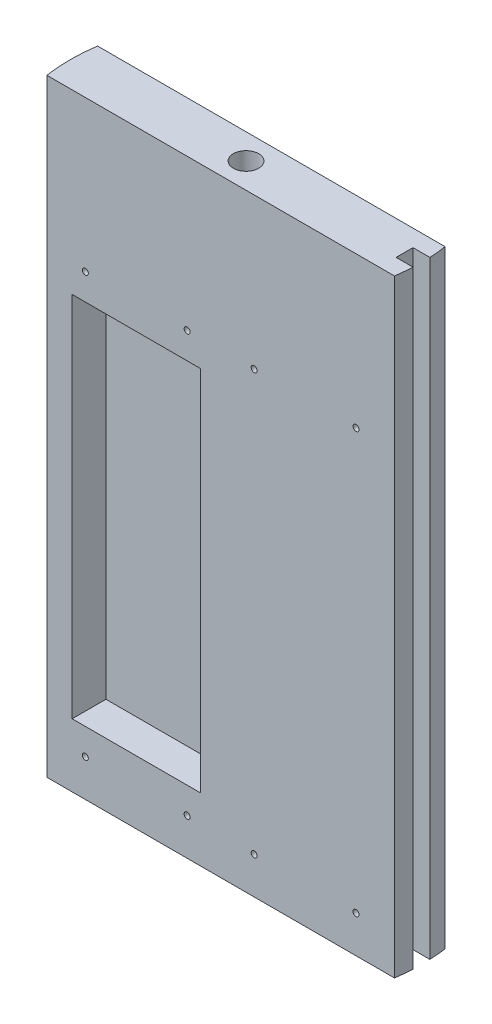
ISO-10303-21;
HEADER;
FILE_DESCRIPTION(('STEP AP214'),'2;1');
FILE_NAME('part.step','',(''),(''),'','','');
FILE_SCHEMA(('AUTOMOTIVE_DESIGN { 1 0 10303 214 1 1 1 1 }'));
ENDSEC;
DATA;
#1=APPLICATION_CONTEXT('core data for automotive mechanical design processes');
#2=APPLICATION_PROTOCOL_DEFINITION('international standard','automotive_design',2000,#1);
#3=PRODUCT_CONTEXT('',#1,'mechanical');
#4=PRODUCT('Part','Part','',(#3));
#5=PRODUCT_RELATED_PRODUCT_CATEGORY('part','',(#4));
#6=PRODUCT_DEFINITION_FORMATION('','',#4);
#7=PRODUCT_DEFINITION_CONTEXT('part definition',#1,'design');
#8=PRODUCT_DEFINITION('design','',#6,#7);
#9=PRODUCT_DEFINITION_SHAPE('','',#8);
#10=(LENGTH_UNIT() NAMED_UNIT(*) SI_UNIT(.MILLI.,.METRE.));
#11=(NAMED_UNIT(*) PLANE_ANGLE_UNIT() SI_UNIT($,.RADIAN.));
#12=(NAMED_UNIT(*) SI_UNIT($,.STERADIAN.) SOLID_ANGLE_UNIT());
#13=UNCERTAINTY_MEASURE_WITH_UNIT(LENGTH_MEASURE(1.E-05),#10,'distance_accuracy_value','');
#14=(GEOMETRIC_REPRESENTATION_CONTEXT(3) GLOBAL_UNCERTAINTY_ASSIGNED_CONTEXT((#13)) GLOBAL_UNIT_ASSIGNED_CONTEXT((#10,
#11,#12)) REPRESENTATION_CONTEXT('',''));
#15=CARTESIAN_POINT('',(0.,0.,0.));
#16=DIRECTION('',(0.,0.,1.));
#17=DIRECTION('',(1.,0.,0.));
#18=AXIS2_PLACEMENT_3D('',#15,#16,#17);
#19=CARTESIAN_POINT('',(0.,-362.046726823853,0.));
#20=DIRECTION('',(0.,1.,0.));
#21=DIRECTION('',(0.,0.,1.));
#22=AXIS2_PLACEMENT_3D('',#19,#20,#21);
#23=CYLINDRICAL_SURFACE('',#22,66.04);
#24=DIRECTION('',(0.,-1.,0.));
#25=VECTOR('',#24,1.);
#26=CARTESIAN_POINT('',(65.9636337310188,0.,3.17499999999985));
#27=LINE('',#26,#25);
#28=CARTESIAN_POINT('',(65.9636337310188,0.,3.17499999999985));
#29=VERTEX_POINT('',#28);
#30=CARTESIAN_POINT('',(65.9636337310188,-228.6,3.17499999999985));
#31=VERTEX_POINT('',#30);
#32=EDGE_CURVE('E235',#29,#31,#27,.T.);
#33=ORIENTED_EDGE('',*,*,#32,.F.);
#34=CARTESIAN_POINT('',(0.,0.,0.));
#35=DIRECTION('',(0.,1.,0.));
#36=DIRECTION('',(0.,0.,1.));
#37=AXIS2_PLACEMENT_3D('',#34,#35,#36);
#38=CIRCLE('',#37,66.04);
#39=CARTESIAN_POINT('',(65.3494910079642,0.,9.52499999999994));
#40=VERTEX_POINT('',#39);
#41=EDGE_CURVE('E309',#40,#29,#38,.T.);
#42=ORIENTED_EDGE('',*,*,#41,.F.);
#43=DIRECTION('',(0.,1.,0.));
#44=VECTOR('',#43,1.);
#45=CARTESIAN_POINT('',(65.3494910079642,-362.046726823853,9.52499999999994));
#46=LINE('',#45,#44);
#47=CARTESIAN_POINT('',(65.3494910079642,-228.6,9.52499999999994));
#48=VERTEX_POINT('',#47);
#49=EDGE_CURVE('E321',#48,#40,#46,.T.);
#50=ORIENTED_EDGE('',*,*,#49,.F.);
#51=CARTESIAN_POINT('',(0.,-228.6,0.));
#52=DIRECTION('',(0.,1.,0.));
#53=DIRECTION('',(0.,0.,1.));
#54=AXIS2_PLACEMENT_3D('',#51,#52,#53);
#55=CIRCLE('',#54,66.04);
#56=EDGE_CURVE('E300',#31,#48,#55,.F.);
#57=ORIENTED_EDGE('',*,*,#56,.F.);
#58=EDGE_LOOP('',(#33,#42,#50,#57));
#59=FACE_BOUND('',#58,.T.);
#60=ADVANCED_FACE('F35',(#59),#23,.T.);
#61=CARTESIAN_POINT('',(-65.3494910079642,-362.046726823853,-9.52499999999998));
#62=DIRECTION('',(0.,0.,-1.));
#63=DIRECTION('',(-1.,0.,0.));
#64=AXIS2_PLACEMENT_3D('',#61,#62,#63);
#65=PLANE('',#64);
#66=DIRECTION('',(0.,-1.,0.));
#67=VECTOR('',#66,1.);
#68=CARTESIAN_POINT('',(55.8375,-66.6125,-9.52499999999998));
#69=LINE('',#68,#67);
#70=CARTESIAN_POINT('',(55.8375,-66.6125,-9.52499999999998));
#71=VERTEX_POINT('',#70);
#72=CARTESIAN_POINT('',(55.8375,-204.7875,-9.52499999999998));
#73=VERTEX_POINT('',#72);
#74=EDGE_CURVE('E50',#71,#73,#69,.T.);
#75=ORIENTED_EDGE('',*,*,#74,.F.);
#76=DIRECTION('',(1.,0.,0.));
#77=VECTOR('',#76,1.);
#78=CARTESIAN_POINT('',(55.8375,-66.6125,-9.52499999999998));
#79=LINE('',#78,#77);
#80=CARTESIAN_POINT('',(7.66249999999997,-66.6125,-9.52499999999998));
#81=VERTEX_POINT('',#80);
#82=EDGE_CURVE('E167',#81,#71,#79,.T.);
#83=ORIENTED_EDGE('',*,*,#82,.F.);
#84=DIRECTION('',(0.,1.,0.));
#85=VECTOR('',#84,1.);
#86=CARTESIAN_POINT('',(7.66249999999997,-66.6125,-9.52499999999998));
#87=LINE('',#86,#85);
#88=CARTESIAN_POINT('',(7.66249999999996,-204.7875,-9.52499999999998));
#89=VERTEX_POINT('',#88);
#90=EDGE_CURVE('E170',#89,#81,#87,.T.);
#91=ORIENTED_EDGE('',*,*,#90,.F.);
#92=DIRECTION('',(-1.,0.,0.));
#93=VECTOR('',#92,1.);
#94=CARTESIAN_POINT('',(55.8375,-204.7875,-9.52499999999998));
#95=LINE('',#94,#93);
#96=EDGE_CURVE('E176',#73,#89,#95,.T.);
#97=ORIENTED_EDGE('',*,*,#96,.F.);
#98=EDGE_LOOP('',(#75,#83,#91,#97));
#99=FACE_BOUND('',#98,.T.);
#100=CARTESIAN_POINT('',(-50.8953948775789,-56.7191999999999,-9.52499999999998));
#101=DIRECTION('',(0.,0.,1.));
#102=DIRECTION('',(1.,0.,0.));
#103=AXIS2_PLACEMENT_3D('',#100,#101,#102);
#104=CIRCLE('',#103,1.13029999999999);
#105=CARTESIAN_POINT('',(-49.765094877579,-56.7191999999999,-9.52499999999998));
#106=VERTEX_POINT('',#105);
#107=EDGE_CURVE('E244',#106,#106,#104,.T.);
#108=ORIENTED_EDGE('',*,*,#107,.T.);
#109=EDGE_LOOP('',(#108));
#110=FACE_BOUND('',#109,.T.);
#111=CARTESIAN_POINT('',(-12.6046051224217,-56.7191999999999,-9.52499999999998));
#112=DIRECTION('',(0.,0.,1.));
#113=DIRECTION('',(1.,0.,0.));
#114=AXIS2_PLACEMENT_3D('',#111,#112,#113);
#115=CIRCLE('',#114,1.1303);
#116=CARTESIAN_POINT('',(-11.4743051224217,-56.7191999999999,-9.52499999999998));
#117=VERTEX_POINT('',#116);
#118=EDGE_CURVE('E250',#117,#117,#115,.T.);
#119=ORIENTED_EDGE('',*,*,#118,.T.);
#120=EDGE_LOOP('',(#119));
#121=FACE_BOUND('',#120,.T.);
#122=CARTESIAN_POINT('',(-12.6046051224217,-214.6808,-9.52499999999998));
#123=DIRECTION('',(0.,0.,1.));
#124=DIRECTION('',(1.,0.,0.));
#125=AXIS2_PLACEMENT_3D('',#122,#123,#124);
#126=CIRCLE('',#125,1.1303);
#127=CARTESIAN_POINT('',(-11.4743051224217,-214.6808,-9.52499999999998));
#128=VERTEX_POINT('',#127);
#129=EDGE_CURVE('E256',#128,#128,#126,.T.);
#130=ORIENTED_EDGE('',*,*,#129,.T.);
#131=EDGE_LOOP('',(#130));
#132=FACE_BOUND('',#131,.T.);
#133=CARTESIAN_POINT('',(-50.8953948775789,-214.6808,-9.52499999999998));
#134=DIRECTION('',(0.,0.,1.));
#135=DIRECTION('',(1.,0.,0.));
#136=AXIS2_PLACEMENT_3D('',#133,#134,#135);
#137=CIRCLE('',#136,1.13029999999999);
#138=CARTESIAN_POINT('',(-49.765094877579,-214.6808,-9.52499999999998));
#139=VERTEX_POINT('',#138);
#140=EDGE_CURVE('E262',#139,#139,#137,.T.);
#141=ORIENTED_EDGE('',*,*,#140,.T.);
#142=EDGE_LOOP('',(#141));
#143=FACE_BOUND('',#142,.T.);
#144=CARTESIAN_POINT('',(12.6046051224217,-56.7191999999999,-9.52499999999998));
#145=DIRECTION('',(0.,0.,1.));
#146=DIRECTION('',(1.,0.,0.));
#147=AXIS2_PLACEMENT_3D('',#144,#145,#146);
#148=CIRCLE('',#147,1.1303);
#149=CARTESIAN_POINT('',(13.7349051224217,-56.7191999999999,-9.52499999999998));
#150=VERTEX_POINT('',#149);
#151=EDGE_CURVE('E268',#150,#150,#148,.T.);
#152=ORIENTED_EDGE('',*,*,#151,.T.);
#153=EDGE_LOOP('',(#152));
#154=FACE_BOUND('',#153,.T.);
#155=CARTESIAN_POINT('',(50.8953948775791,-56.7191999999999,-9.52499999999998));
#156=DIRECTION('',(0.,0.,1.));
#157=DIRECTION('',(1.,0.,0.));
#158=AXIS2_PLACEMENT_3D('',#155,#156,#157);
#159=CIRCLE('',#158,1.13029999999999);
#160=CARTESIAN_POINT('',(52.0256948775791,-56.7191999999999,-9.52499999999998));
#161=VERTEX_POINT('',#160);
#162=EDGE_CURVE('E274',#161,#161,#159,.T.);
#163=ORIENTED_EDGE('',*,*,#162,.T.);
#164=EDGE_LOOP('',(#163));
#165=FACE_BOUND('',#164,.T.);
#166=CARTESIAN_POINT('',(12.6046051224214,-214.6808,-9.52499999999998));
#167=DIRECTION('',(0.,0.,1.));
#168=DIRECTION('',(1.,0.,0.));
#169=AXIS2_PLACEMENT_3D('',#166,#167,#168);
#170=CIRCLE('',#169,1.1303);
#171=CARTESIAN_POINT('',(13.7349051224214,-214.6808,-9.52499999999998));
#172=VERTEX_POINT('',#171);
#173=EDGE_CURVE('E280',#172,#172,#170,.T.);
#174=ORIENTED_EDGE('',*,*,#173,.T.);
#175=EDGE_LOOP('',(#174));
#176=FACE_BOUND('',#175,.T.);
#177=DIRECTION('',(1.,0.,0.));
#178=VECTOR('',#177,1.);
#179=CARTESIAN_POINT('',(-65.3494910079642,-228.6,-9.52499999999998));
#180=LINE('',#179,#178);
#181=CARTESIAN_POINT('',(-65.3494910079642,-228.6,-9.52499999999998));
#182=VERTEX_POINT('',#181);
#183=CARTESIAN_POINT('',(65.3494910079642,-228.6,-9.52499999999998));
#184=VERTEX_POINT('',#183);
#185=EDGE_CURVE('E299',#182,#184,#180,.T.);
#186=ORIENTED_EDGE('',*,*,#185,.F.);
#187=DIRECTION('',(0.,1.,0.));
#188=VECTOR('',#187,1.);
#189=CARTESIAN_POINT('',(-65.3494910079642,-362.046726823853,-9.52499999999998));
#190=LINE('',#189,#188);
#191=CARTESIAN_POINT('',(-65.3494910079642,0.,-9.52499999999998));
#192=VERTEX_POINT('',#191);
#193=EDGE_CURVE('E316',#182,#192,#190,.T.);
#194=ORIENTED_EDGE('',*,*,#193,.T.);
#195=DIRECTION('',(-1.,0.,0.));
#196=VECTOR('',#195,1.);
#197=CARTESIAN_POINT('',(-65.3494910079642,0.,-9.52499999999998));
#198=LINE('',#197,#196);
#199=CARTESIAN_POINT('',(65.3494910079642,0.,-9.52499999999998));
#200=VERTEX_POINT('',#199);
#201=EDGE_CURVE('E312',#200,#192,#198,.T.);
#202=ORIENTED_EDGE('',*,*,#201,.F.);
#203=DIRECTION('',(0.,1.,0.));
#204=VECTOR('',#203,1.);
#205=CARTESIAN_POINT('',(65.3494910079642,-362.046726823853,-9.52499999999998));
#206=LINE('',#205,#204);
#207=EDGE_CURVE('E318',#184,#200,#206,.T.);
#208=ORIENTED_EDGE('',*,*,#207,.F.);
#209=EDGE_LOOP('',(#186,#194,#202,#208));
#210=FACE_BOUND('',#209,.T.);
#211=CARTESIAN_POINT('',(50.8953948775787,-214.6808,-9.52499999999998));
#212=DIRECTION('',(0.,0.,1.));
#213=DIRECTION('',(1.,0.,0.));
#214=AXIS2_PLACEMENT_3D('',#211,#212,#213);
#215=CIRCLE('',#214,1.13029999999999);
#216=CARTESIAN_POINT('',(52.0256948775787,-214.6808,-9.52499999999998));
#217=VERTEX_POINT('',#216);
#218=EDGE_CURVE('E286',#217,#217,#215,.T.);
#219=ORIENTED_EDGE('',*,*,#218,.T.);
#220=EDGE_LOOP('',(#219));
#221=FACE_BOUND('',#220,.T.);
#222=ADVANCED_FACE('F341',(#99,#110,#121,#132,#143,#154,#165,#176,#210,#221),#65,.T.);
#223=CARTESIAN_POINT('',(0.,-362.046726823853,0.));
#224=DIRECTION('',(0.,1.,0.));
#225=DIRECTION('',(0.,0.,1.));
#226=AXIS2_PLACEMENT_3D('',#223,#224,#225);
#227=CYLINDRICAL_SURFACE('',#226,66.04);
#228=CARTESIAN_POINT('',(0.,-228.6,0.));
#229=DIRECTION('',(0.,1.,0.));
#230=DIRECTION('',(0.,0.,1.));
#231=AXIS2_PLACEMENT_3D('',#228,#229,#230);
#232=CIRCLE('',#231,66.04);
#233=CARTESIAN_POINT('',(-65.3494910079642,-228.6,9.52500000000002));
#234=VERTEX_POINT('',#233);
#235=EDGE_CURVE('E43',#234,#182,#232,.F.);
#236=ORIENTED_EDGE('',*,*,#235,.F.);
#237=DIRECTION('',(0.,1.,0.));
#238=VECTOR('',#237,1.);
#239=CARTESIAN_POINT('',(-65.3494910079642,-362.046726823853,9.52500000000002));
#240=LINE('',#239,#238);
#241=CARTESIAN_POINT('',(-65.3494910079642,0.,9.52500000000002));
#242=VERTEX_POINT('',#241);
#243=EDGE_CURVE('E315',#234,#242,#240,.T.);
#244=ORIENTED_EDGE('',*,*,#243,.T.);
#245=CARTESIAN_POINT('',(0.,0.,0.));
#246=DIRECTION('',(0.,1.,0.));
#247=DIRECTION('',(0.,0.,1.));
#248=AXIS2_PLACEMENT_3D('',#245,#246,#247);
#249=CIRCLE('',#248,66.04);
#250=EDGE_CURVE('E293',#192,#242,#249,.T.);
#251=ORIENTED_EDGE('',*,*,#250,.F.);
#252=ORIENTED_EDGE('',*,*,#193,.F.);
#253=EDGE_LOOP('',(#236,#244,#251,#252));
#254=FACE_BOUND('',#253,.T.);
#255=ADVANCED_FACE('F37',(#254),#227,.T.);
#256=DIRECTION('',(0.,-1.,0.));
#257=VECTOR('',#256,1.);
#258=CARTESIAN_POINT('',(65.9636337310188,0.,-3.17500000000015));
#259=LINE('',#258,#257);
#260=CARTESIAN_POINT('',(65.9636337310188,0.,-3.17500000000015));
#261=VERTEX_POINT('',#260);
#262=CARTESIAN_POINT('',(65.9636337310188,-228.6,-3.17500000000015));
#263=VERTEX_POINT('',#262);
#264=EDGE_CURVE('E237',#261,#263,#259,.T.);
#265=ORIENTED_EDGE('',*,*,#264,.T.);
#266=EDGE_CURVE('E296',#184,#263,#55,.F.);
#267=ORIENTED_EDGE('',*,*,#266,.F.);
#268=ORIENTED_EDGE('',*,*,#207,.T.);
#269=EDGE_CURVE('E308',#261,#200,#38,.T.);
#270=ORIENTED_EDGE('',*,*,#269,.F.);
#271=EDGE_LOOP('',(#265,#267,#268,#270));
#272=FACE_BOUND('',#271,.T.);
#273=ADVANCED_FACE('F349',(#272),#23,.T.);
#274=CARTESIAN_POINT('',(-65.3494910079642,-362.046726823853,9.52500000000002));
#275=DIRECTION('',(0.,0.,1.));
#276=DIRECTION('',(1.,0.,0.));
#277=AXIS2_PLACEMENT_3D('',#274,#275,#276);
#278=PLANE('',#277);
#279=DIRECTION('',(0.,1.,0.));
#280=VECTOR('',#279,1.);
#281=CARTESIAN_POINT('',(-7.6625,-204.7875,9.52499999999998));
#282=LINE('',#281,#280);
#283=CARTESIAN_POINT('',(-7.6625,-204.7875,9.52499999999998));
#284=VERTEX_POINT('',#283);
#285=CARTESIAN_POINT('',(-7.6625,-66.6125,9.52499999999999));
#286=VERTEX_POINT('',#285);
#287=EDGE_CURVE('E58',#284,#286,#282,.T.);
#288=ORIENTED_EDGE('',*,*,#287,.F.);
#289=DIRECTION('',(1.,0.,0.));
#290=VECTOR('',#289,1.);
#291=CARTESIAN_POINT('',(-7.6625,-204.7875,9.52499999999998));
#292=LINE('',#291,#290);
#293=CARTESIAN_POINT('',(-55.8375,-204.7875,9.52499999999998));
#294=VERTEX_POINT('',#293);
#295=EDGE_CURVE('E189',#294,#284,#292,.T.);
#296=ORIENTED_EDGE('',*,*,#295,.F.);
#297=DIRECTION('',(0.,-1.,0.));
#298=VECTOR('',#297,1.);
#299=CARTESIAN_POINT('',(-55.8375,-204.7875,9.52499999999998));
#300=LINE('',#299,#298);
#301=CARTESIAN_POINT('',(-55.8375,-66.6125,9.52499999999998));
#302=VERTEX_POINT('',#301);
#303=EDGE_CURVE('E203',#302,#294,#300,.T.);
#304=ORIENTED_EDGE('',*,*,#303,.F.);
#305=DIRECTION('',(-1.,0.,0.));
#306=VECTOR('',#305,1.);
#307=CARTESIAN_POINT('',(-7.6625,-66.6125,9.52499999999998));
#308=LINE('',#307,#306);
#309=EDGE_CURVE('E200',#286,#302,#308,.T.);
#310=ORIENTED_EDGE('',*,*,#309,.F.);
#311=EDGE_LOOP('',(#288,#296,#304,#310));
#312=FACE_BOUND('',#311,.T.);
#313=CARTESIAN_POINT('',(-50.8953948775789,-56.7191999999999,9.52499999999998));
#314=DIRECTION('',(0.,0.,1.));
#315=DIRECTION('',(1.,0.,0.));
#316=AXIS2_PLACEMENT_3D('',#313,#314,#315);
#317=CIRCLE('',#316,1.13029999999999);
#318=CARTESIAN_POINT('',(-49.765094877579,-56.7191999999999,9.52499999999998));
#319=VERTEX_POINT('',#318);
#320=EDGE_CURVE('E234',#319,#319,#317,.T.);
#321=ORIENTED_EDGE('',*,*,#320,.F.);
#322=EDGE_LOOP('',(#321));
#323=FACE_BOUND('',#322,.T.);
#324=CARTESIAN_POINT('',(-12.6046051224217,-56.7191999999999,9.52499999999998));
#325=DIRECTION('',(0.,0.,1.));
#326=DIRECTION('',(1.,0.,0.));
#327=AXIS2_PLACEMENT_3D('',#324,#325,#326);
#328=CIRCLE('',#327,1.13029999999999);
#329=CARTESIAN_POINT('',(-11.4743051224217,-56.7191999999999,9.52499999999998));
#330=VERTEX_POINT('',#329);
#331=EDGE_CURVE('E247',#330,#330,#328,.T.);
#332=ORIENTED_EDGE('',*,*,#331,.F.);
#333=EDGE_LOOP('',(#332));
#334=FACE_BOUND('',#333,.T.);
#335=CARTESIAN_POINT('',(-12.6046051224217,-214.6808,9.52499999999998));
#336=DIRECTION('',(0.,0.,1.));
#337=DIRECTION('',(1.,0.,0.));
#338=AXIS2_PLACEMENT_3D('',#335,#336,#337);
#339=CIRCLE('',#338,1.13029999999999);
#340=CARTESIAN_POINT('',(-11.4743051224217,-214.6808,9.52499999999998));
#341=VERTEX_POINT('',#340);
#342=EDGE_CURVE('E253',#341,#341,#339,.T.);
#343=ORIENTED_EDGE('',*,*,#342,.F.);
#344=EDGE_LOOP('',(#343));
#345=FACE_BOUND('',#344,.T.);
#346=CARTESIAN_POINT('',(-50.8953948775789,-214.6808,9.52499999999998));
#347=DIRECTION('',(0.,0.,1.));
#348=DIRECTION('',(1.,0.,0.));
#349=AXIS2_PLACEMENT_3D('',#346,#347,#348);
#350=CIRCLE('',#349,1.13029999999999);
#351=CARTESIAN_POINT('',(-49.765094877579,-214.6808,9.52499999999998));
#352=VERTEX_POINT('',#351);
#353=EDGE_CURVE('E259',#352,#352,#350,.T.);
#354=ORIENTED_EDGE('',*,*,#353,.F.);
#355=EDGE_LOOP('',(#354));
#356=FACE_BOUND('',#355,.T.);
#357=CARTESIAN_POINT('',(12.6046051224217,-56.7191999999999,9.52499999999998));
#358=DIRECTION('',(0.,0.,1.));
#359=DIRECTION('',(1.,0.,0.));
#360=AXIS2_PLACEMENT_3D('',#357,#358,#359);
#361=CIRCLE('',#360,1.13029999999999);
#362=CARTESIAN_POINT('',(13.7349051224217,-56.7191999999999,9.52499999999998));
#363=VERTEX_POINT('',#362);
#364=EDGE_CURVE('E265',#363,#363,#361,.T.);
#365=ORIENTED_EDGE('',*,*,#364,.F.);
#366=EDGE_LOOP('',(#365));
#367=FACE_BOUND('',#366,.T.);
#368=CARTESIAN_POINT('',(50.8953948775791,-56.7191999999999,9.52499999999998));
#369=DIRECTION('',(0.,0.,1.));
#370=DIRECTION('',(1.,0.,0.));
#371=AXIS2_PLACEMENT_3D('',#368,#369,#370);
#372=CIRCLE('',#371,1.13029999999999);
#373=CARTESIAN_POINT('',(52.0256948775791,-56.7191999999999,9.52499999999998));
#374=VERTEX_POINT('',#373);
#375=EDGE_CURVE('E271',#374,#374,#372,.T.);
#376=ORIENTED_EDGE('',*,*,#375,.F.);
#377=EDGE_LOOP('',(#376));
#378=FACE_BOUND('',#377,.T.);
#379=CARTESIAN_POINT('',(12.6046051224214,-214.6808,9.52499999999998));
#380=DIRECTION('',(0.,0.,1.));
#381=DIRECTION('',(1.,0.,0.));
#382=AXIS2_PLACEMENT_3D('',#379,#380,#381);
#383=CIRCLE('',#382,1.13029999999999);
#384=CARTESIAN_POINT('',(13.7349051224214,-214.6808,9.52499999999998));
#385=VERTEX_POINT('',#384);
#386=EDGE_CURVE('E277',#385,#385,#383,.T.);
#387=ORIENTED_EDGE('',*,*,#386,.F.);
#388=EDGE_LOOP('',(#387));
#389=FACE_BOUND('',#388,.T.);
#390=CARTESIAN_POINT('',(50.8953948775787,-214.6808,9.52499999999998));
#391=DIRECTION('',(0.,0.,1.));
#392=DIRECTION('',(1.,0.,0.));
#393=AXIS2_PLACEMENT_3D('',#390,#391,#392);
#394=CIRCLE('',#393,1.13029999999999);
#395=CARTESIAN_POINT('',(52.0256948775787,-214.6808,9.52499999999998));
#396=VERTEX_POINT('',#395);
#397=EDGE_CURVE('E283',#396,#396,#394,.T.);
#398=ORIENTED_EDGE('',*,*,#397,.F.);
#399=EDGE_LOOP('',(#398));
#400=FACE_BOUND('',#399,.T.);
#401=DIRECTION('',(-1.,0.,0.));
#402=VECTOR('',#401,1.);
#403=CARTESIAN_POINT('',(-65.3494910079642,-228.6,9.52500000000002));
#404=LINE('',#403,#402);
#405=EDGE_CURVE('E11',#48,#234,#404,.T.);
#406=ORIENTED_EDGE('',*,*,#405,.F.);
#407=ORIENTED_EDGE('',*,*,#49,.T.);
#408=DIRECTION('',(1.,0.,0.));
#409=VECTOR('',#408,1.);
#410=CARTESIAN_POINT('',(-65.3494910079642,0.,9.52500000000002));
#411=LINE('',#410,#409);
#412=EDGE_CURVE('E305',#242,#40,#411,.T.);
#413=ORIENTED_EDGE('',*,*,#412,.F.);
#414=ORIENTED_EDGE('',*,*,#243,.F.);
#415=EDGE_LOOP('',(#406,#407,#413,#414));
#416=FACE_BOUND('',#415,.T.);
#417=ADVANCED_FACE('F330',(#312,#323,#334,#345,#356,#367,#378,#389,#400,#416),#278,.T.);
#418=CARTESIAN_POINT('',(0.,0.,0.));
#419=DIRECTION('',(0.,1.,0.));
#420=DIRECTION('',(0.,0.,1.));
#421=AXIS2_PLACEMENT_3D('',#418,#419,#420);
#422=PLANE('',#421);
#423=DIRECTION('',(-1.,0.,0.));
#424=VECTOR('',#423,1.);
#425=CARTESIAN_POINT('',(59.6136337310188,0.,3.17499999999985));
#426=LINE('',#425,#424);
#427=CARTESIAN_POINT('',(59.6136337310188,0.,3.17499999999985));
#428=VERTEX_POINT('',#427);
#429=EDGE_CURVE('E223',#29,#428,#426,.T.);
#430=ORIENTED_EDGE('',*,*,#429,.T.);
#431=DIRECTION('',(0.,0.,-1.));
#432=VECTOR('',#431,1.);
#433=CARTESIAN_POINT('',(59.6136337310188,0.,3.17499999999985));
#434=LINE('',#433,#432);
#435=CARTESIAN_POINT('',(59.6136337310188,0.,-3.17500000000015));
#436=VERTEX_POINT('',#435);
#437=EDGE_CURVE('E216',#428,#436,#434,.T.);
#438=ORIENTED_EDGE('',*,*,#437,.T.);
#439=DIRECTION('',(1.,0.,0.));
#440=VECTOR('',#439,1.);
#441=CARTESIAN_POINT('',(59.6136337310188,0.,-3.17500000000015));
#442=LINE('',#441,#440);
#443=EDGE_CURVE('E219',#436,#261,#442,.T.);
#444=ORIENTED_EDGE('',*,*,#443,.T.);
#445=ORIENTED_EDGE('',*,*,#269,.T.);
#446=ORIENTED_EDGE('',*,*,#201,.T.);
#447=ORIENTED_EDGE('',*,*,#250,.T.);
#448=ORIENTED_EDGE('',*,*,#412,.T.);
#449=ORIENTED_EDGE('',*,*,#41,.T.);
#450=EDGE_LOOP('',(#430,#438,#444,#445,#446,#447,#448,#449));
#451=FACE_BOUND('',#450,.T.);
#452=CARTESIAN_POINT('',(0.,0.,0.));
#453=DIRECTION('',(0.,1.,0.));
#454=DIRECTION('',(0.,0.,1.));
#455=AXIS2_PLACEMENT_3D('',#452,#453,#454);
#456=CIRCLE('',#455,4.7625);
#457=CARTESIAN_POINT('',(0.,0.,4.7625));
#458=VERTEX_POINT('',#457);
#459=EDGE_CURVE('E289',#458,#458,#456,.T.);
#460=ORIENTED_EDGE('',*,*,#459,.F.);
#461=EDGE_LOOP('',(#460));
#462=FACE_BOUND('',#461,.T.);
#463=ADVANCED_FACE('F334',(#451,#462),#422,.T.);
#464=CARTESIAN_POINT('',(0.,-228.6,0.));
#465=DIRECTION('',(0.,1.,0.));
#466=DIRECTION('',(0.,0.,1.));
#467=AXIS2_PLACEMENT_3D('',#464,#465,#466);
#468=PLANE('',#467);
#469=CARTESIAN_POINT('',(0.,-228.6,0.));
#470=DIRECTION('',(0.,1.,0.));
#471=DIRECTION('',(0.,0.,1.));
#472=AXIS2_PLACEMENT_3D('',#469,#470,#471);
#473=CIRCLE('',#472,4.7625);
#474=CARTESIAN_POINT('',(0.,-228.6,4.7625));
#475=VERTEX_POINT('',#474);
#476=EDGE_CURVE('E290',#475,#475,#473,.T.);
#477=ORIENTED_EDGE('',*,*,#476,.T.);
#478=EDGE_LOOP('',(#477));
#479=FACE_BOUND('',#478,.T.);
#480=DIRECTION('',(0.,0.,-1.));
#481=VECTOR('',#480,1.);
#482=CARTESIAN_POINT('',(59.6136337310188,-228.6,3.17499999999985));
#483=LINE('',#482,#481);
#484=CARTESIAN_POINT('',(59.6136337310188,-228.6,3.17499999999985));
#485=VERTEX_POINT('',#484);
#486=CARTESIAN_POINT('',(59.6136337310188,-228.6,-3.17500000000015));
#487=VERTEX_POINT('',#486);
#488=EDGE_CURVE('E210',#485,#487,#483,.T.);
#489=ORIENTED_EDGE('',*,*,#488,.F.);
#490=DIRECTION('',(-1.,0.,0.));
#491=VECTOR('',#490,1.);
#492=CARTESIAN_POINT('',(59.6136337310188,-228.6,3.17499999999985));
#493=LINE('',#492,#491);
#494=EDGE_CURVE('E220',#31,#485,#493,.T.);
#495=ORIENTED_EDGE('',*,*,#494,.F.);
#496=ORIENTED_EDGE('',*,*,#56,.T.);
#497=ORIENTED_EDGE('',*,*,#405,.T.);
#498=ORIENTED_EDGE('',*,*,#235,.T.);
#499=ORIENTED_EDGE('',*,*,#185,.T.);
#500=ORIENTED_EDGE('',*,*,#266,.T.);
#501=DIRECTION('',(1.,0.,0.));
#502=VECTOR('',#501,1.);
#503=CARTESIAN_POINT('',(59.6136337310188,-228.6,-3.17500000000015));
#504=LINE('',#503,#502);
#505=EDGE_CURVE('E228',#487,#263,#504,.T.);
#506=ORIENTED_EDGE('',*,*,#505,.F.);
#507=EDGE_LOOP('',(#489,#495,#496,#497,#498,#499,#500,#506));
#508=FACE_BOUND('',#507,.T.);
#509=ADVANCED_FACE('F346',(#479,#508),#468,.F.);
#510=CARTESIAN_POINT('',(0.,-228.6,0.));
#511=DIRECTION('',(0.,1.,0.));
#512=DIRECTION('',(0.,0.,1.));
#513=AXIS2_PLACEMENT_3D('',#510,#511,#512);
#514=CYLINDRICAL_SURFACE('',#513,4.7625);
#515=ORIENTED_EDGE('',*,*,#476,.F.);
#516=EDGE_LOOP('',(#515));
#517=FACE_BOUND('',#516,.T.);
#518=ORIENTED_EDGE('',*,*,#459,.T.);
#519=EDGE_LOOP('',(#518));
#520=FACE_BOUND('',#519,.T.);
#521=ADVANCED_FACE('F585',(#517,#520),#514,.F.);
#522=CARTESIAN_POINT('',(50.8953948775787,-214.6808,9.52499999999998));
#523=DIRECTION('',(0.,0.,1.));
#524=DIRECTION('',(1.,0.,0.));
#525=AXIS2_PLACEMENT_3D('',#522,#523,#524);
#526=CYLINDRICAL_SURFACE('',#525,1.13029999999999);
#527=ORIENTED_EDGE('',*,*,#218,.F.);
#528=EDGE_LOOP('',(#527));
#529=FACE_BOUND('',#528,.T.);
#530=ORIENTED_EDGE('',*,*,#397,.T.);
#531=EDGE_LOOP('',(#530));
#532=FACE_BOUND('',#531,.T.);
#533=ADVANCED_FACE('F576',(#529,#532),#526,.F.);
#534=CARTESIAN_POINT('',(12.6046051224214,-214.6808,9.52499999999998));
#535=DIRECTION('',(0.,0.,1.));
#536=DIRECTION('',(1.,0.,0.));
#537=AXIS2_PLACEMENT_3D('',#534,#535,#536);
#538=CYLINDRICAL_SURFACE('',#537,1.13029999999999);
#539=ORIENTED_EDGE('',*,*,#173,.F.);
#540=EDGE_LOOP('',(#539));
#541=FACE_BOUND('',#540,.T.);
#542=ORIENTED_EDGE('',*,*,#386,.T.);
#543=EDGE_LOOP('',(#542));
#544=FACE_BOUND('',#543,.T.);
#545=ADVANCED_FACE('F567',(#541,#544),#538,.F.);
#546=CARTESIAN_POINT('',(50.8953948775791,-56.7191999999999,9.52499999999998));
#547=DIRECTION('',(0.,0.,1.));
#548=DIRECTION('',(1.,0.,0.));
#549=AXIS2_PLACEMENT_3D('',#546,#547,#548);
#550=CYLINDRICAL_SURFACE('',#549,1.13029999999999);
#551=ORIENTED_EDGE('',*,*,#162,.F.);
#552=EDGE_LOOP('',(#551));
#553=FACE_BOUND('',#552,.T.);
#554=ORIENTED_EDGE('',*,*,#375,.T.);
#555=EDGE_LOOP('',(#554));
#556=FACE_BOUND('',#555,.T.);
#557=ADVANCED_FACE('F557',(#553,#556),#550,.F.);
#558=CARTESIAN_POINT('',(12.6046051224217,-56.7191999999999,9.52499999999998));
#559=DIRECTION('',(0.,0.,1.));
#560=DIRECTION('',(1.,0.,0.));
#561=AXIS2_PLACEMENT_3D('',#558,#559,#560);
#562=CYLINDRICAL_SURFACE('',#561,1.13029999999999);
#563=ORIENTED_EDGE('',*,*,#151,.F.);
#564=EDGE_LOOP('',(#563));
#565=FACE_BOUND('',#564,.T.);
#566=ORIENTED_EDGE('',*,*,#364,.T.);
#567=EDGE_LOOP('',(#566));
#568=FACE_BOUND('',#567,.T.);
#569=ADVANCED_FACE('F547',(#565,#568),#562,.F.);
#570=CARTESIAN_POINT('',(-50.8953948775789,-214.6808,9.52499999999998));
#571=DIRECTION('',(0.,0.,1.));
#572=DIRECTION('',(1.,0.,0.));
#573=AXIS2_PLACEMENT_3D('',#570,#571,#572);
#574=CYLINDRICAL_SURFACE('',#573,1.13029999999999);
#575=ORIENTED_EDGE('',*,*,#140,.F.);
#576=EDGE_LOOP('',(#575));
#577=FACE_BOUND('',#576,.T.);
#578=ORIENTED_EDGE('',*,*,#353,.T.);
#579=EDGE_LOOP('',(#578));
#580=FACE_BOUND('',#579,.T.);
#581=ADVANCED_FACE('F537',(#577,#580),#574,.F.);
#582=CARTESIAN_POINT('',(-12.6046051224217,-214.6808,9.52499999999998));
#583=DIRECTION('',(0.,0.,1.));
#584=DIRECTION('',(1.,0.,0.));
#585=AXIS2_PLACEMENT_3D('',#582,#583,#584);
#586=CYLINDRICAL_SURFACE('',#585,1.13029999999999);
#587=ORIENTED_EDGE('',*,*,#129,.F.);
#588=EDGE_LOOP('',(#587));
#589=FACE_BOUND('',#588,.T.);
#590=ORIENTED_EDGE('',*,*,#342,.T.);
#591=EDGE_LOOP('',(#590));
#592=FACE_BOUND('',#591,.T.);
#593=ADVANCED_FACE('F527',(#589,#592),#586,.F.);
#594=CARTESIAN_POINT('',(-12.6046051224217,-56.7191999999999,9.52499999999998));
#595=DIRECTION('',(0.,0.,1.));
#596=DIRECTION('',(1.,0.,0.));
#597=AXIS2_PLACEMENT_3D('',#594,#595,#596);
#598=CYLINDRICAL_SURFACE('',#597,1.13029999999999);
#599=ORIENTED_EDGE('',*,*,#118,.F.);
#600=EDGE_LOOP('',(#599));
#601=FACE_BOUND('',#600,.T.);
#602=ORIENTED_EDGE('',*,*,#331,.T.);
#603=EDGE_LOOP('',(#602));
#604=FACE_BOUND('',#603,.T.);
#605=ADVANCED_FACE('F517',(#601,#604),#598,.F.);
#606=CARTESIAN_POINT('',(-50.8953948775789,-56.7191999999999,9.52499999999998));
#607=DIRECTION('',(0.,0.,1.));
#608=DIRECTION('',(1.,0.,0.));
#609=AXIS2_PLACEMENT_3D('',#606,#607,#608);
#610=CYLINDRICAL_SURFACE('',#609,1.13029999999999);
#611=ORIENTED_EDGE('',*,*,#107,.F.);
#612=EDGE_LOOP('',(#611));
#613=FACE_BOUND('',#612,.T.);
#614=ORIENTED_EDGE('',*,*,#320,.T.);
#615=EDGE_LOOP('',(#614));
#616=FACE_BOUND('',#615,.T.);
#617=ADVANCED_FACE('F370',(#613,#616),#610,.F.);
#618=CARTESIAN_POINT('',(59.6136337310188,0.,3.17499999999985));
#619=DIRECTION('',(-1.,0.,0.));
#620=DIRECTION('',(0.,0.,1.));
#621=AXIS2_PLACEMENT_3D('',#618,#619,#620);
#622=PLANE('',#621);
#623=ORIENTED_EDGE('',*,*,#488,.T.);
#624=DIRECTION('',(0.,-1.,0.));
#625=VECTOR('',#624,1.);
#626=CARTESIAN_POINT('',(59.6136337310188,0.,-3.17500000000015));
#627=LINE('',#626,#625);
#628=EDGE_CURVE('E226',#436,#487,#627,.T.);
#629=ORIENTED_EDGE('',*,*,#628,.F.);
#630=ORIENTED_EDGE('',*,*,#437,.F.);
#631=DIRECTION('',(0.,-1.,0.));
#632=VECTOR('',#631,1.);
#633=CARTESIAN_POINT('',(59.6136337310188,0.,3.17499999999985));
#634=LINE('',#633,#632);
#635=EDGE_CURVE('E232',#428,#485,#634,.T.);
#636=ORIENTED_EDGE('',*,*,#635,.T.);
#637=EDGE_LOOP('',(#623,#629,#630,#636));
#638=FACE_BOUND('',#637,.T.);
#639=ADVANCED_FACE('F355',(#638),#622,.F.);
#640=CARTESIAN_POINT('',(59.6136337310188,0.,3.17499999999985));
#641=DIRECTION('',(0.,0.,1.));
#642=DIRECTION('',(1.,0.,0.));
#643=AXIS2_PLACEMENT_3D('',#640,#641,#642);
#644=PLANE('',#643);
#645=ORIENTED_EDGE('',*,*,#494,.T.);
#646=ORIENTED_EDGE('',*,*,#635,.F.);
#647=ORIENTED_EDGE('',*,*,#429,.F.);
#648=ORIENTED_EDGE('',*,*,#32,.T.);
#649=EDGE_LOOP('',(#645,#646,#647,#648));
#650=FACE_BOUND('',#649,.T.);
#651=ADVANCED_FACE('F361',(#650),#644,.F.);
#652=CARTESIAN_POINT('',(59.6136337310188,0.,-3.17500000000015));
#653=DIRECTION('',(0.,0.,-1.));
#654=DIRECTION('',(-1.,0.,0.));
#655=AXIS2_PLACEMENT_3D('',#652,#653,#654);
#656=PLANE('',#655);
#657=ORIENTED_EDGE('',*,*,#505,.T.);
#658=ORIENTED_EDGE('',*,*,#264,.F.);
#659=ORIENTED_EDGE('',*,*,#443,.F.);
#660=ORIENTED_EDGE('',*,*,#628,.T.);
#661=EDGE_LOOP('',(#657,#658,#659,#660));
#662=FACE_BOUND('',#661,.T.);
#663=ADVANCED_FACE('F352',(#662),#656,.F.);
#664=CARTESIAN_POINT('',(-7.6625,-204.7875,-3.17500000000002));
#665=DIRECTION('',(1.,0.,0.));
#666=DIRECTION('',(0.,0.,-1.));
#667=AXIS2_PLACEMENT_3D('',#664,#665,#666);
#668=PLANE('',#667);
#669=ORIENTED_EDGE('',*,*,#287,.T.);
#670=DIRECTION('',(0.,0.,1.));
#671=VECTOR('',#670,1.);
#672=CARTESIAN_POINT('',(-7.6625,-66.6125,-3.17500000000002));
#673=LINE('',#672,#671);
#674=CARTESIAN_POINT('',(-7.6625,-66.6125,-3.17500000000002));
#675=VERTEX_POINT('',#674);
#676=EDGE_CURVE('E198',#675,#286,#673,.T.);
#677=ORIENTED_EDGE('',*,*,#676,.F.);
#678=DIRECTION('',(0.,1.,0.));
#679=VECTOR('',#678,1.);
#680=CARTESIAN_POINT('',(-7.6625,-204.7875,-3.17500000000002));
#681=LINE('',#680,#679);
#682=CARTESIAN_POINT('',(-7.6625,-204.7875,-3.17500000000002));
#683=VERTEX_POINT('',#682);
#684=EDGE_CURVE('E185',#683,#675,#681,.T.);
#685=ORIENTED_EDGE('',*,*,#684,.F.);
#686=DIRECTION('',(0.,0.,1.));
#687=VECTOR('',#686,1.);
#688=CARTESIAN_POINT('',(-7.6625,-204.7875,-3.17500000000002));
#689=LINE('',#688,#687);
#690=EDGE_CURVE('E208',#683,#284,#689,.T.);
#691=ORIENTED_EDGE('',*,*,#690,.T.);
#692=EDGE_LOOP('',(#669,#677,#685,#691));
#693=FACE_BOUND('',#692,.T.);
#694=ADVANCED_FACE('F368',(#693),#668,.F.);
#695=CARTESIAN_POINT('',(-7.6625,-204.7875,-3.17500000000002));
#696=DIRECTION('',(0.,-1.,0.));
#697=DIRECTION('',(0.,0.,-1.));
#698=AXIS2_PLACEMENT_3D('',#695,#696,#697);
#699=PLANE('',#698);
#700=ORIENTED_EDGE('',*,*,#295,.T.);
#701=ORIENTED_EDGE('',*,*,#690,.F.);
#702=DIRECTION('',(1.,0.,0.));
#703=VECTOR('',#702,1.);
#704=CARTESIAN_POINT('',(-7.6625,-204.7875,-3.17500000000002));
#705=LINE('',#704,#703);
#706=CARTESIAN_POINT('',(-55.8375,-204.7875,-3.17500000000002));
#707=VERTEX_POINT('',#706);
#708=EDGE_CURVE('E195',#707,#683,#705,.T.);
#709=ORIENTED_EDGE('',*,*,#708,.F.);
#710=DIRECTION('',(0.,0.,1.));
#711=VECTOR('',#710,1.);
#712=CARTESIAN_POINT('',(-55.8375,-204.7875,-3.17500000000002));
#713=LINE('',#712,#711);
#714=EDGE_CURVE('E211',#707,#294,#713,.T.);
#715=ORIENTED_EDGE('',*,*,#714,.T.);
#716=EDGE_LOOP('',(#700,#701,#709,#715));
#717=FACE_BOUND('',#716,.T.);
#718=ADVANCED_FACE('F453',(#717),#699,.F.);
#719=CARTESIAN_POINT('',(-55.8375,-204.7875,-3.17500000000002));
#720=DIRECTION('',(-1.,0.,0.));
#721=DIRECTION('',(0.,0.,1.));
#722=AXIS2_PLACEMENT_3D('',#719,#720,#721);
#723=PLANE('',#722);
#724=ORIENTED_EDGE('',*,*,#303,.T.);
#725=ORIENTED_EDGE('',*,*,#714,.F.);
#726=DIRECTION('',(0.,-1.,0.));
#727=VECTOR('',#726,1.);
#728=CARTESIAN_POINT('',(-55.8375,-204.7875,-3.17500000000002));
#729=LINE('',#728,#727);
#730=CARTESIAN_POINT('',(-55.8375,-66.6125,-3.17500000000002));
#731=VERTEX_POINT('',#730);
#732=EDGE_CURVE('E192',#731,#707,#729,.T.);
#733=ORIENTED_EDGE('',*,*,#732,.F.);
#734=DIRECTION('',(0.,0.,1.));
#735=VECTOR('',#734,1.);
#736=CARTESIAN_POINT('',(-55.8375,-66.6125,-3.17500000000002));
#737=LINE('',#736,#735);
#738=EDGE_CURVE('E213',#731,#302,#737,.T.);
#739=ORIENTED_EDGE('',*,*,#738,.T.);
#740=EDGE_LOOP('',(#724,#725,#733,#739));
#741=FACE_BOUND('',#740,.T.);
#742=ADVANCED_FACE('F456',(#741),#723,.F.);
#743=CARTESIAN_POINT('',(-7.6625,-66.6125,-3.17500000000002));
#744=DIRECTION('',(0.,1.,0.));
#745=DIRECTION('',(-1.,0.,0.));
#746=AXIS2_PLACEMENT_3D('',#743,#744,#745);
#747=PLANE('',#746);
#748=ORIENTED_EDGE('',*,*,#309,.T.);
#749=ORIENTED_EDGE('',*,*,#738,.F.);
#750=DIRECTION('',(-1.,0.,0.));
#751=VECTOR('',#750,1.);
#752=CARTESIAN_POINT('',(-7.6625,-66.6125,-3.17500000000002));
#753=LINE('',#752,#751);
#754=EDGE_CURVE('E188',#675,#731,#753,.T.);
#755=ORIENTED_EDGE('',*,*,#754,.F.);
#756=ORIENTED_EDGE('',*,*,#676,.T.);
#757=EDGE_LOOP('',(#748,#749,#755,#756));
#758=FACE_BOUND('',#757,.T.);
#759=ADVANCED_FACE('F451',(#758),#747,.F.);
#760=CARTESIAN_POINT('',(0.,0.,-3.17500000000002));
#761=DIRECTION('',(0.,0.,1.));
#762=DIRECTION('',(1.,0.,0.));
#763=AXIS2_PLACEMENT_3D('',#760,#761,#762);
#764=PLANE('',#763);
#765=ORIENTED_EDGE('',*,*,#684,.T.);
#766=ORIENTED_EDGE('',*,*,#754,.T.);
#767=ORIENTED_EDGE('',*,*,#732,.T.);
#768=ORIENTED_EDGE('',*,*,#708,.T.);
#769=EDGE_LOOP('',(#765,#766,#767,#768));
#770=FACE_BOUND('',#769,.T.);
#771=ADVANCED_FACE('F401',(#770),#764,.T.);
#772=CARTESIAN_POINT('',(55.8375,-66.6125,3.17500000000002));
#773=DIRECTION('',(1.,0.,0.));
#774=DIRECTION('',(0.,0.,-1.));
#775=AXIS2_PLACEMENT_3D('',#772,#773,#774);
#776=PLANE('',#775);
#777=ORIENTED_EDGE('',*,*,#74,.T.);
#778=DIRECTION('',(0.,0.,-1.));
#779=VECTOR('',#778,1.);
#780=CARTESIAN_POINT('',(55.8375,-204.7875,3.17500000000002));
#781=LINE('',#780,#779);
#782=CARTESIAN_POINT('',(55.8375,-204.7875,3.17500000000002));
#783=VERTEX_POINT('',#782);
#784=EDGE_CURVE('E145',#783,#73,#781,.T.);
#785=ORIENTED_EDGE('',*,*,#784,.F.);
#786=DIRECTION('',(0.,-1.,0.));
#787=VECTOR('',#786,1.);
#788=CARTESIAN_POINT('',(55.8375,-66.6125,3.17500000000002));
#789=LINE('',#788,#787);
#790=CARTESIAN_POINT('',(55.8375,-66.6125,3.17500000000002));
#791=VERTEX_POINT('',#790);
#792=EDGE_CURVE('E149',#791,#783,#789,.T.);
#793=ORIENTED_EDGE('',*,*,#792,.F.);
#794=DIRECTION('',(0.,0.,-1.));
#795=VECTOR('',#794,1.);
#796=CARTESIAN_POINT('',(55.8375,-66.6125,3.17500000000002));
#797=LINE('',#796,#795);
#798=EDGE_CURVE('E180',#791,#71,#797,.T.);
#799=ORIENTED_EDGE('',*,*,#798,.T.);
#800=EDGE_LOOP('',(#777,#785,#793,#799));
#801=FACE_BOUND('',#800,.T.);
#802=ADVANCED_FACE('F147',(#801),#776,.F.);
#803=CARTESIAN_POINT('',(55.8375,-66.6125,3.17500000000002));
#804=DIRECTION('',(0.,1.,0.));
#805=DIRECTION('',(0.,0.,1.));
#806=AXIS2_PLACEMENT_3D('',#803,#804,#805);
#807=PLANE('',#806);
#808=ORIENTED_EDGE('',*,*,#82,.T.);
#809=ORIENTED_EDGE('',*,*,#798,.F.);
#810=DIRECTION('',(1.,0.,0.));
#811=VECTOR('',#810,1.);
#812=CARTESIAN_POINT('',(55.8375,-66.6125,3.17500000000002));
#813=LINE('',#812,#811);
#814=CARTESIAN_POINT('',(7.66249999999997,-66.6125,3.17500000000002));
#815=VERTEX_POINT('',#814);
#816=EDGE_CURVE('E155',#815,#791,#813,.T.);
#817=ORIENTED_EDGE('',*,*,#816,.F.);
#818=DIRECTION('',(0.,0.,-1.));
#819=VECTOR('',#818,1.);
#820=CARTESIAN_POINT('',(7.66249999999997,-66.6125,3.17500000000002));
#821=LINE('',#820,#819);
#822=EDGE_CURVE('E182',#815,#81,#821,.T.);
#823=ORIENTED_EDGE('',*,*,#822,.T.);
#824=EDGE_LOOP('',(#808,#809,#817,#823));
#825=FACE_BOUND('',#824,.T.);
#826=ADVANCED_FACE('F410',(#825),#807,.F.);
#827=CARTESIAN_POINT('',(7.66249999999997,-66.6125,3.17500000000002));
#828=DIRECTION('',(-1.,0.,0.));
#829=DIRECTION('',(0.,-1.,0.));
#830=AXIS2_PLACEMENT_3D('',#827,#828,#829);
#831=PLANE('',#830);
#832=ORIENTED_EDGE('',*,*,#90,.T.);
#833=ORIENTED_EDGE('',*,*,#822,.F.);
#834=DIRECTION('',(0.,1.,0.));
#835=VECTOR('',#834,1.);
#836=CARTESIAN_POINT('',(7.66249999999997,-66.6125,3.17500000000002));
#837=LINE('',#836,#835);
#838=CARTESIAN_POINT('',(7.66249999999996,-204.7875,3.17500000000002));
#839=VERTEX_POINT('',#838);
#840=EDGE_CURVE('E163',#839,#815,#837,.T.);
#841=ORIENTED_EDGE('',*,*,#840,.F.);
#842=DIRECTION('',(0.,0.,-1.));
#843=VECTOR('',#842,1.);
#844=CARTESIAN_POINT('',(7.66249999999996,-204.7875,3.17500000000002));
#845=LINE('',#844,#843);
#846=EDGE_CURVE('E154',#839,#89,#845,.T.);
#847=ORIENTED_EDGE('',*,*,#846,.T.);
#848=EDGE_LOOP('',(#832,#833,#841,#847));
#849=FACE_BOUND('',#848,.T.);
#850=ADVANCED_FACE('F419',(#849),#831,.F.);
#851=CARTESIAN_POINT('',(55.8375,-204.7875,3.17500000000002));
#852=DIRECTION('',(0.,-1.,0.));
#853=DIRECTION('',(0.,0.,-1.));
#854=AXIS2_PLACEMENT_3D('',#851,#852,#853);
#855=PLANE('',#854);
#856=ORIENTED_EDGE('',*,*,#96,.T.);
#857=ORIENTED_EDGE('',*,*,#846,.F.);
#858=DIRECTION('',(-1.,0.,0.));
#859=VECTOR('',#858,1.);
#860=CARTESIAN_POINT('',(55.8375,-204.7875,3.17500000000002));
#861=LINE('',#860,#859);
#862=EDGE_CURVE('E158',#783,#839,#861,.T.);
#863=ORIENTED_EDGE('',*,*,#862,.F.);
#864=ORIENTED_EDGE('',*,*,#784,.T.);
#865=EDGE_LOOP('',(#856,#857,#863,#864));
#866=FACE_BOUND('',#865,.T.);
#867=ADVANCED_FACE('F159',(#866),#855,.F.);
#868=CARTESIAN_POINT('',(0.,0.,3.17500000000002));
#869=DIRECTION('',(0.,0.,-1.));
#870=DIRECTION('',(-1.,0.,0.));
#871=AXIS2_PLACEMENT_3D('',#868,#869,#870);
#872=PLANE('',#871);
#873=ORIENTED_EDGE('',*,*,#792,.T.);
#874=ORIENTED_EDGE('',*,*,#862,.T.);
#875=ORIENTED_EDGE('',*,*,#840,.T.);
#876=ORIENTED_EDGE('',*,*,#816,.T.);
#877=EDGE_LOOP('',(#873,#874,#875,#876));
#878=FACE_BOUND('',#877,.T.);
#879=ADVANCED_FACE('F165',(#878),#872,.T.);
#880=CLOSED_SHELL('',(#60,#222,#255,#273,#417,#463,#509,#521,#533,#545,#557,#569,#581,#593,#605,
#617,#639,#651,#663,#694,#718,#742,#759,#771,#802,#826,#850,#867,#879));
#881=MANIFOLD_SOLID_BREP('B2',#880);
#882=ADVANCED_BREP_SHAPE_REPRESENTATION('',(#18,#881),#14);
#883=SHAPE_DEFINITION_REPRESENTATION(#9,#882);
ENDSEC;
END-ISO-10303-21;
